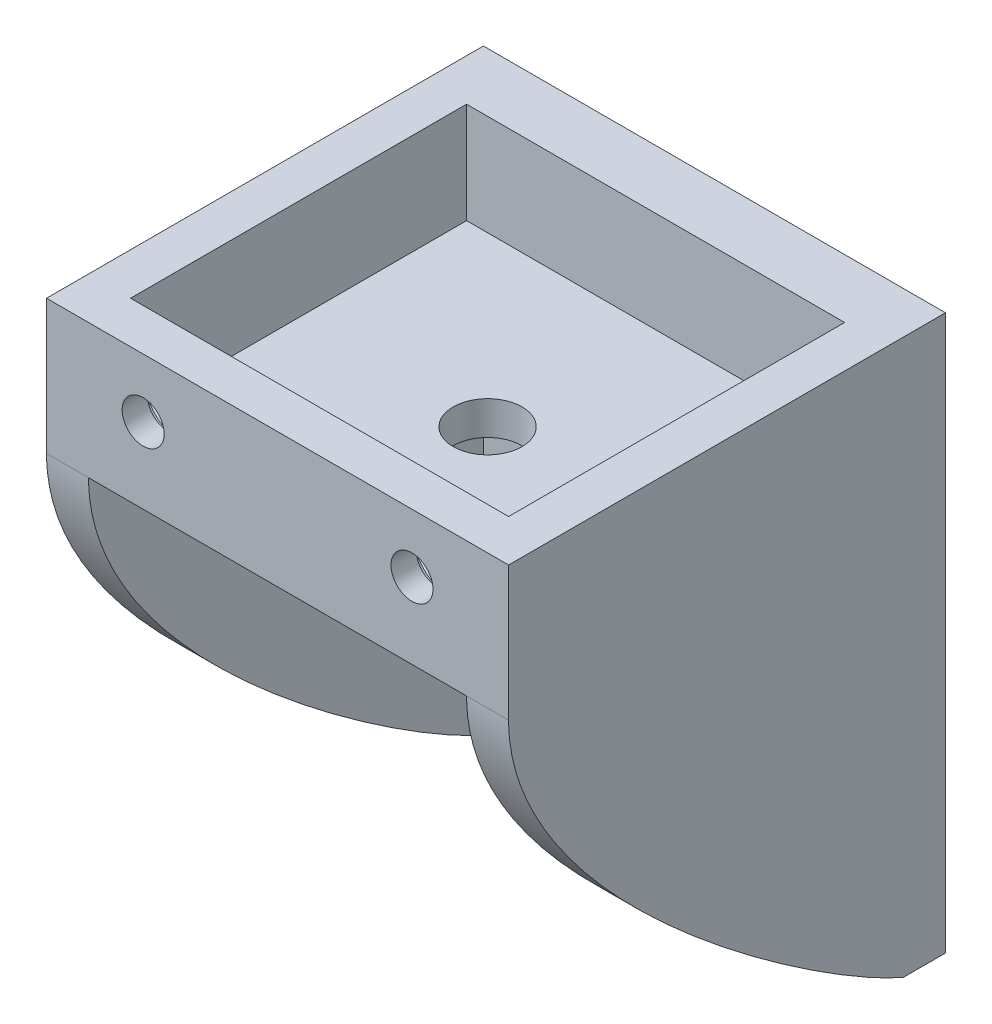
ISO-10303-21;
HEADER;
FILE_DESCRIPTION(('STEP AP214'),'2;1');
FILE_NAME('part.step','',(''),(''),'','','');
FILE_SCHEMA(('AUTOMOTIVE_DESIGN { 1 0 10303 214 1 1 1 1 }'));
ENDSEC;
DATA;
#1=APPLICATION_CONTEXT('core data for automotive mechanical design processes');
#2=APPLICATION_PROTOCOL_DEFINITION('international standard','automotive_design',2000,#1);
#3=PRODUCT_CONTEXT('',#1,'mechanical');
#4=PRODUCT('Part','Part','',(#3));
#5=PRODUCT_RELATED_PRODUCT_CATEGORY('part','',(#4));
#6=PRODUCT_DEFINITION_FORMATION('','',#4);
#7=PRODUCT_DEFINITION_CONTEXT('part definition',#1,'design');
#8=PRODUCT_DEFINITION('design','',#6,#7);
#9=PRODUCT_DEFINITION_SHAPE('','',#8);
#10=(LENGTH_UNIT() NAMED_UNIT(*) SI_UNIT(.MILLI.,.METRE.));
#11=(NAMED_UNIT(*) PLANE_ANGLE_UNIT() SI_UNIT($,.RADIAN.));
#12=(NAMED_UNIT(*) SI_UNIT($,.STERADIAN.) SOLID_ANGLE_UNIT());
#13=UNCERTAINTY_MEASURE_WITH_UNIT(LENGTH_MEASURE(1.E-05),#10,'distance_accuracy_value','');
#14=(GEOMETRIC_REPRESENTATION_CONTEXT(3) GLOBAL_UNCERTAINTY_ASSIGNED_CONTEXT((#13)) GLOBAL_UNIT_ASSIGNED_CONTEXT((#10,
#11,#12)) REPRESENTATION_CONTEXT('',''));
#15=CARTESIAN_POINT('',(0.,0.,0.));
#16=DIRECTION('',(0.,0.,1.));
#17=DIRECTION('',(1.,0.,0.));
#18=AXIS2_PLACEMENT_3D('',#15,#16,#17);
#19=CARTESIAN_POINT('',(16.,34.,47.));
#20=DIRECTION('',(0.,0.,1.));
#21=DIRECTION('',(1.,0.,0.));
#22=AXIS2_PLACEMENT_3D('',#19,#20,#21);
#23=CYLINDRICAL_SURFACE('',#22,2.5);
#24=CARTESIAN_POINT('',(16.,34.,52.));
#25=DIRECTION('',(0.,0.,1.));
#26=DIRECTION('',(1.,0.,0.));
#27=AXIS2_PLACEMENT_3D('',#24,#25,#26);
#28=CIRCLE('',#27,2.5);
#29=CARTESIAN_POINT('',(18.5,34.,52.));
#30=VERTEX_POINT('',#29);
#31=EDGE_CURVE('E182',#30,#30,#28,.T.);
#32=ORIENTED_EDGE('',*,*,#31,.T.);
#33=EDGE_LOOP('',(#32));
#34=FACE_BOUND('',#33,.T.);
#35=CARTESIAN_POINT('',(16.,34.,49.));
#36=DIRECTION('',(0.,0.,-1.));
#37=DIRECTION('',(-1.,0.,0.));
#38=AXIS2_PLACEMENT_3D('',#35,#36,#37);
#39=CIRCLE('',#38,2.5);
#40=CARTESIAN_POINT('',(13.5,34.,49.));
#41=VERTEX_POINT('',#40);
#42=EDGE_CURVE('E229',#41,#41,#39,.F.);
#43=ORIENTED_EDGE('',*,*,#42,.F.);
#44=EDGE_LOOP('',(#43));
#45=FACE_BOUND('',#44,.T.);
#46=ADVANCED_FACE('F33',(#34,#45),#23,.F.);
#47=CARTESIAN_POINT('',(0.,41.,27.));
#48=DIRECTION('',(0.,-1.,0.));
#49=DIRECTION('',(0.,0.,-1.));
#50=AXIS2_PLACEMENT_3D('',#47,#48,#49);
#51=CYLINDRICAL_SURFACE('',#50,4.1);
#52=CARTESIAN_POINT('',(0.,25.,27.));
#53=DIRECTION('',(0.,-1.,0.));
#54=DIRECTION('',(0.,0.,-1.));
#55=AXIS2_PLACEMENT_3D('',#52,#53,#54);
#56=CIRCLE('',#55,4.1);
#57=CARTESIAN_POINT('',(0.,25.,22.9));
#58=VERTEX_POINT('',#57);
#59=EDGE_CURVE('E275',#58,#58,#56,.T.);
#60=ORIENTED_EDGE('',*,*,#59,.T.);
#61=EDGE_LOOP('',(#60));
#62=FACE_BOUND('',#61,.T.);
#63=CARTESIAN_POINT('',(0.,29.,27.));
#64=DIRECTION('',(0.,1.,0.));
#65=DIRECTION('',(0.,0.,1.));
#66=AXIS2_PLACEMENT_3D('',#63,#64,#65);
#67=CIRCLE('',#66,4.1);
#68=CARTESIAN_POINT('',(0.,29.,31.1));
#69=VERTEX_POINT('',#68);
#70=EDGE_CURVE('E188',#69,#69,#67,.F.);
#71=ORIENTED_EDGE('',*,*,#70,.F.);
#72=EDGE_LOOP('',(#71));
#73=FACE_BOUND('',#72,.T.);
#74=ADVANCED_FACE('F439',(#62,#73),#51,.F.);
#75=CARTESIAN_POINT('',(0.,0.,5.));
#76=DIRECTION('',(0.,0.,1.));
#77=DIRECTION('',(1.,0.,0.));
#78=AXIS2_PLACEMENT_3D('',#75,#76,#77);
#79=PLANE('',#78);
#80=DIRECTION('',(1.,0.,0.));
#81=VECTOR('',#80,1.);
#82=CARTESIAN_POINT('',(-27.5,-25.,5.));
#83=LINE('',#82,#81);
#84=CARTESIAN_POINT('',(-22.5,-25.,5.));
#85=VERTEX_POINT('',#84);
#86=CARTESIAN_POINT('',(22.5,-25.,5.));
#87=VERTEX_POINT('',#86);
#88=EDGE_CURVE('E280',#85,#87,#83,.T.);
#89=ORIENTED_EDGE('',*,*,#88,.T.);
#90=DIRECTION('',(0.,-1.,0.));
#91=VECTOR('',#90,1.);
#92=CARTESIAN_POINT('',(22.5,-25.,5.));
#93=LINE('',#92,#91);
#94=CARTESIAN_POINT('',(22.5,-15.,5.));
#95=VERTEX_POINT('',#94);
#96=EDGE_CURVE('E211',#95,#87,#93,.T.);
#97=ORIENTED_EDGE('',*,*,#96,.F.);
#98=CARTESIAN_POINT('',(17.5,-15.,5.));
#99=DIRECTION('',(0.,0.,1.));
#100=DIRECTION('',(1.,0.,0.));
#101=AXIS2_PLACEMENT_3D('',#98,#99,#100);
#102=CIRCLE('',#101,5.);
#103=EDGE_CURVE('E304',#95,#95,#102,.T.);
#104=ORIENTED_EDGE('',*,*,#103,.F.);
#105=CARTESIAN_POINT('',(22.5,15.,5.));
#106=VERTEX_POINT('',#105);
#107=EDGE_CURVE('E223',#106,#95,#93,.T.);
#108=ORIENTED_EDGE('',*,*,#107,.F.);
#109=CARTESIAN_POINT('',(17.5,15.,5.));
#110=DIRECTION('',(0.,0.,1.));
#111=DIRECTION('',(1.,0.,0.));
#112=AXIS2_PLACEMENT_3D('',#109,#110,#111);
#113=CIRCLE('',#112,5.);
#114=EDGE_CURVE('E293',#106,#106,#113,.T.);
#115=ORIENTED_EDGE('',*,*,#114,.F.);
#116=CARTESIAN_POINT('',(22.5,25.,5.));
#117=VERTEX_POINT('',#116);
#118=EDGE_CURVE('E196',#117,#106,#93,.T.);
#119=ORIENTED_EDGE('',*,*,#118,.F.);
#120=DIRECTION('',(-1.,0.,0.));
#121=VECTOR('',#120,1.);
#122=CARTESIAN_POINT('',(-27.5,25.,5.));
#123=LINE('',#122,#121);
#124=CARTESIAN_POINT('',(-22.5,25.,5.));
#125=VERTEX_POINT('',#124);
#126=EDGE_CURVE('E332',#117,#125,#123,.T.);
#127=ORIENTED_EDGE('',*,*,#126,.T.);
#128=DIRECTION('',(0.,-1.,0.));
#129=VECTOR('',#128,1.);
#130=CARTESIAN_POINT('',(-22.5,-25.,5.));
#131=LINE('',#130,#129);
#132=CARTESIAN_POINT('',(-22.5,15.,5.));
#133=VERTEX_POINT('',#132);
#134=EDGE_CURVE('E349',#125,#133,#131,.T.);
#135=ORIENTED_EDGE('',*,*,#134,.T.);
#136=CARTESIAN_POINT('',(-17.5,15.,5.));
#137=DIRECTION('',(0.,0.,1.));
#138=DIRECTION('',(-1.,0.,0.));
#139=AXIS2_PLACEMENT_3D('',#136,#137,#138);
#140=CIRCLE('',#139,5.);
#141=EDGE_CURVE('E297',#133,#133,#140,.T.);
#142=ORIENTED_EDGE('',*,*,#141,.F.);
#143=CARTESIAN_POINT('',(-22.5,-15.,5.));
#144=VERTEX_POINT('',#143);
#145=EDGE_CURVE('E344',#133,#144,#131,.T.);
#146=ORIENTED_EDGE('',*,*,#145,.T.);
#147=CARTESIAN_POINT('',(-17.5,-15.,5.));
#148=DIRECTION('',(0.,0.,1.));
#149=DIRECTION('',(1.,0.,0.));
#150=AXIS2_PLACEMENT_3D('',#147,#148,#149);
#151=CIRCLE('',#150,5.);
#152=EDGE_CURVE('E303',#144,#144,#151,.T.);
#153=ORIENTED_EDGE('',*,*,#152,.F.);
#154=EDGE_CURVE('E340',#144,#85,#131,.T.);
#155=ORIENTED_EDGE('',*,*,#154,.T.);
#156=EDGE_LOOP('',(#89,#97,#104,#108,#115,#119,#127,#135,#142,#146,#153,#155));
#157=FACE_BOUND('',#156,.T.);
#158=ADVANCED_FACE('F390',(#157),#79,.T.);
#159=CARTESIAN_POINT('',(0.,25.,0.));
#160=DIRECTION('',(0.,1.,0.));
#161=DIRECTION('',(0.,0.,1.));
#162=AXIS2_PLACEMENT_3D('',#159,#160,#161);
#163=PLANE('',#162);
#164=ORIENTED_EDGE('',*,*,#59,.F.);
#165=EDGE_LOOP('',(#164));
#166=FACE_BOUND('',#165,.T.);
#167=DIRECTION('',(0.,0.,-1.));
#168=VECTOR('',#167,1.);
#169=CARTESIAN_POINT('',(22.5,25.,5.));
#170=LINE('',#169,#168);
#171=CARTESIAN_POINT('',(22.5,25.,52.));
#172=VERTEX_POINT('',#171);
#173=EDGE_CURVE('E225',#172,#117,#170,.T.);
#174=ORIENTED_EDGE('',*,*,#173,.F.);
#175=DIRECTION('',(1.,0.,0.));
#176=VECTOR('',#175,1.);
#177=CARTESIAN_POINT('',(-27.5,25.,52.));
#178=LINE('',#177,#176);
#179=CARTESIAN_POINT('',(-22.5,25.,52.));
#180=VERTEX_POINT('',#179);
#181=EDGE_CURVE('E265',#180,#172,#178,.T.);
#182=ORIENTED_EDGE('',*,*,#181,.F.);
#183=DIRECTION('',(0.,0.,-1.));
#184=VECTOR('',#183,1.);
#185=CARTESIAN_POINT('',(-22.5,25.,5.));
#186=LINE('',#185,#184);
#187=EDGE_CURVE('E345',#180,#125,#186,.T.);
#188=ORIENTED_EDGE('',*,*,#187,.T.);
#189=ORIENTED_EDGE('',*,*,#126,.F.);
#190=EDGE_LOOP('',(#174,#182,#188,#189));
#191=FACE_BOUND('',#190,.T.);
#192=ADVANCED_FACE('F410',(#166,#191),#163,.F.);
#193=CARTESIAN_POINT('',(-17.5,-15.,5.));
#194=DIRECTION('',(0.,0.,-1.));
#195=DIRECTION('',(-1.,0.,0.));
#196=AXIS2_PLACEMENT_3D('',#193,#194,#195);
#197=CYLINDRICAL_SURFACE('',#196,2.5);
#198=CARTESIAN_POINT('',(-17.5,-15.,0.));
#199=DIRECTION('',(0.,0.,1.));
#200=DIRECTION('',(1.,0.,0.));
#201=AXIS2_PLACEMENT_3D('',#198,#199,#200);
#202=CIRCLE('',#201,2.5);
#203=CARTESIAN_POINT('',(-15.,-15.,0.));
#204=VERTEX_POINT('',#203);
#205=EDGE_CURVE('E328',#204,#204,#202,.T.);
#206=ORIENTED_EDGE('',*,*,#205,.F.);
#207=EDGE_LOOP('',(#206));
#208=FACE_BOUND('',#207,.T.);
#209=CARTESIAN_POINT('',(-17.5,-15.,3.));
#210=DIRECTION('',(0.,0.,1.));
#211=DIRECTION('',(1.,0.,0.));
#212=AXIS2_PLACEMENT_3D('',#209,#210,#211);
#213=CIRCLE('',#212,2.5);
#214=CARTESIAN_POINT('',(-15.,-15.,3.));
#215=VERTEX_POINT('',#214);
#216=EDGE_CURVE('E322',#215,#215,#213,.T.);
#217=ORIENTED_EDGE('',*,*,#216,.T.);
#218=EDGE_LOOP('',(#217));
#219=FACE_BOUND('',#218,.T.);
#220=ADVANCED_FACE('F484',(#208,#219),#197,.F.);
#221=CARTESIAN_POINT('',(17.5,-15.,5.));
#222=DIRECTION('',(0.,0.,-1.));
#223=DIRECTION('',(-1.,0.,0.));
#224=AXIS2_PLACEMENT_3D('',#221,#222,#223);
#225=CYLINDRICAL_SURFACE('',#224,2.5);
#226=CARTESIAN_POINT('',(17.5,-15.,0.));
#227=DIRECTION('',(0.,0.,1.));
#228=DIRECTION('',(-1.,0.,0.));
#229=AXIS2_PLACEMENT_3D('',#226,#227,#228);
#230=CIRCLE('',#229,2.5);
#231=CARTESIAN_POINT('',(15.,-15.,0.));
#232=VERTEX_POINT('',#231);
#233=EDGE_CURVE('E325',#232,#232,#230,.T.);
#234=ORIENTED_EDGE('',*,*,#233,.F.);
#235=EDGE_LOOP('',(#234));
#236=FACE_BOUND('',#235,.T.);
#237=CARTESIAN_POINT('',(17.5,-15.,3.));
#238=DIRECTION('',(0.,0.,1.));
#239=DIRECTION('',(1.,0.,0.));
#240=AXIS2_PLACEMENT_3D('',#237,#238,#239);
#241=CIRCLE('',#240,2.5);
#242=CARTESIAN_POINT('',(20.,-15.,3.));
#243=VERTEX_POINT('',#242);
#244=EDGE_CURVE('E783',#243,#243,#241,.T.);
#245=ORIENTED_EDGE('',*,*,#244,.T.);
#246=EDGE_LOOP('',(#245));
#247=FACE_BOUND('',#246,.T.);
#248=ADVANCED_FACE('F518',(#236,#247),#225,.F.);
#249=CARTESIAN_POINT('',(17.5,15.,5.));
#250=DIRECTION('',(0.,0.,-1.));
#251=DIRECTION('',(-1.,0.,0.));
#252=AXIS2_PLACEMENT_3D('',#249,#250,#251);
#253=CYLINDRICAL_SURFACE('',#252,2.5);
#254=CARTESIAN_POINT('',(17.5,15.,0.));
#255=DIRECTION('',(0.,0.,1.));
#256=DIRECTION('',(1.,0.,0.));
#257=AXIS2_PLACEMENT_3D('',#254,#255,#256);
#258=CIRCLE('',#257,2.5);
#259=CARTESIAN_POINT('',(20.,15.,0.));
#260=VERTEX_POINT('',#259);
#261=EDGE_CURVE('E321',#260,#260,#258,.T.);
#262=ORIENTED_EDGE('',*,*,#261,.F.);
#263=EDGE_LOOP('',(#262));
#264=FACE_BOUND('',#263,.T.);
#265=CARTESIAN_POINT('',(17.5,15.,3.));
#266=DIRECTION('',(0.,0.,1.));
#267=DIRECTION('',(1.,0.,0.));
#268=AXIS2_PLACEMENT_3D('',#265,#266,#267);
#269=CIRCLE('',#268,2.5);
#270=CARTESIAN_POINT('',(20.,15.,3.));
#271=VERTEX_POINT('',#270);
#272=EDGE_CURVE('E782',#271,#271,#269,.T.);
#273=ORIENTED_EDGE('',*,*,#272,.T.);
#274=EDGE_LOOP('',(#273));
#275=FACE_BOUND('',#274,.T.);
#276=ADVANCED_FACE('F514',(#264,#275),#253,.F.);
#277=CARTESIAN_POINT('',(0.,0.,0.));
#278=DIRECTION('',(0.,0.,1.));
#279=DIRECTION('',(1.,0.,0.));
#280=AXIS2_PLACEMENT_3D('',#277,#278,#279);
#281=PLANE('',#280);
#282=DIRECTION('',(0.,1.,0.));
#283=VECTOR('',#282,1.);
#284=CARTESIAN_POINT('',(27.5,25.,0.));
#285=LINE('',#284,#283);
#286=CARTESIAN_POINT('',(27.5,-25.,0.));
#287=VERTEX_POINT('',#286);
#288=CARTESIAN_POINT('',(27.5,41.,0.));
#289=VERTEX_POINT('',#288);
#290=EDGE_CURVE('E331',#287,#289,#285,.T.);
#291=ORIENTED_EDGE('',*,*,#290,.F.);
#292=DIRECTION('',(1.,0.,0.));
#293=VECTOR('',#292,1.);
#294=CARTESIAN_POINT('',(-27.5,-25.,0.));
#295=LINE('',#294,#293);
#296=CARTESIAN_POINT('',(-27.5,-25.,0.));
#297=VERTEX_POINT('',#296);
#298=EDGE_CURVE('E333',#297,#287,#295,.T.);
#299=ORIENTED_EDGE('',*,*,#298,.F.);
#300=DIRECTION('',(0.,-1.,0.));
#301=VECTOR('',#300,1.);
#302=CARTESIAN_POINT('',(-27.5,25.,0.));
#303=LINE('',#302,#301);
#304=CARTESIAN_POINT('',(-27.5,41.,0.));
#305=VERTEX_POINT('',#304);
#306=EDGE_CURVE('E376',#305,#297,#303,.T.);
#307=ORIENTED_EDGE('',*,*,#306,.F.);
#308=DIRECTION('',(-1.,0.,0.));
#309=VECTOR('',#308,1.);
#310=CARTESIAN_POINT('',(-27.5,41.,0.));
#311=LINE('',#310,#309);
#312=EDGE_CURVE('E286',#289,#305,#311,.T.);
#313=ORIENTED_EDGE('',*,*,#312,.F.);
#314=EDGE_LOOP('',(#291,#299,#307,#313));
#315=FACE_BOUND('',#314,.T.);
#316=ORIENTED_EDGE('',*,*,#205,.T.);
#317=EDGE_LOOP('',(#316));
#318=FACE_BOUND('',#317,.T.);
#319=ORIENTED_EDGE('',*,*,#233,.T.);
#320=EDGE_LOOP('',(#319));
#321=FACE_BOUND('',#320,.T.);
#322=ORIENTED_EDGE('',*,*,#261,.T.);
#323=EDGE_LOOP('',(#322));
#324=FACE_BOUND('',#323,.T.);
#325=CARTESIAN_POINT('',(-17.5,15.,0.));
#326=DIRECTION('',(0.,0.,1.));
#327=DIRECTION('',(-1.,0.,0.));
#328=AXIS2_PLACEMENT_3D('',#325,#326,#327);
#329=CIRCLE('',#328,2.5);
#330=CARTESIAN_POINT('',(-20.,15.,0.));
#331=VERTEX_POINT('',#330);
#332=EDGE_CURVE('E318',#331,#331,#329,.T.);
#333=ORIENTED_EDGE('',*,*,#332,.T.);
#334=EDGE_LOOP('',(#333));
#335=FACE_BOUND('',#334,.T.);
#336=ADVANCED_FACE('F517',(#315,#318,#321,#324,#335),#281,.F.);
#337=CARTESIAN_POINT('',(27.5,25.,5.));
#338=DIRECTION('',(-1.,0.,0.));
#339=DIRECTION('',(0.,-1.,0.));
#340=AXIS2_PLACEMENT_3D('',#337,#338,#339);
#341=PLANE('',#340);
#342=ORIENTED_EDGE('',*,*,#290,.T.);
#343=DIRECTION('',(0.,0.,-1.));
#344=VECTOR('',#343,1.);
#345=CARTESIAN_POINT('',(27.5,41.,0.));
#346=LINE('',#345,#344);
#347=CARTESIAN_POINT('',(27.5,41.,52.));
#348=VERTEX_POINT('',#347);
#349=EDGE_CURVE('E364',#348,#289,#346,.T.);
#350=ORIENTED_EDGE('',*,*,#349,.F.);
#351=DIRECTION('',(0.,-1.,0.));
#352=VECTOR('',#351,1.);
#353=CARTESIAN_POINT('',(27.5,41.,52.));
#354=LINE('',#353,#352);
#355=CARTESIAN_POINT('',(27.5,25.,52.));
#356=VERTEX_POINT('',#355);
#357=EDGE_CURVE('E288',#348,#356,#354,.T.);
#358=ORIENTED_EDGE('',*,*,#357,.T.);
#359=CARTESIAN_POINT('',(27.5,-25.,4.99999999999999));
#360=CARTESIAN_POINT('',(27.5,-20.7199182538741,15.2666346797888));
#361=CARTESIAN_POINT('',(27.5,4.23297016209857,51.9999999999999));
#362=CARTESIAN_POINT('',(27.5,25.,52.));
#363=B_SPLINE_CURVE_WITH_KNOTS('',3,(#359,#360,#361,#362),.UNSPECIFIED.,.F.,.F.,(4,4),(0.,
0.911487556733468),.UNSPECIFIED.);
#364=CARTESIAN_POINT('',(27.5,-25.,5.));
#365=VERTEX_POINT('',#364);
#366=EDGE_CURVE('E212',#365,#356,#363,.T.);
#367=ORIENTED_EDGE('',*,*,#366,.F.);
#368=DIRECTION('',(0.,0.,-1.));
#369=VECTOR('',#368,1.);
#370=CARTESIAN_POINT('',(27.5,-25.,5.));
#371=LINE('',#370,#369);
#372=EDGE_CURVE('E42',#365,#287,#371,.T.);
#373=ORIENTED_EDGE('',*,*,#372,.T.);
#374=EDGE_LOOP('',(#342,#350,#358,#367,#373));
#375=FACE_BOUND('',#374,.T.);
#376=ADVANCED_FACE('F35',(#375),#341,.F.);
#377=CARTESIAN_POINT('',(-27.5,25.,5.));
#378=DIRECTION('',(1.,0.,0.));
#379=DIRECTION('',(0.,1.,0.));
#380=AXIS2_PLACEMENT_3D('',#377,#378,#379);
#381=PLANE('',#380);
#382=DIRECTION('',(0.,0.,-1.));
#383=VECTOR('',#382,1.);
#384=CARTESIAN_POINT('',(-27.5,-25.,5.));
#385=LINE('',#384,#383);
#386=CARTESIAN_POINT('',(-27.5,-25.,5.));
#387=VERTEX_POINT('',#386);
#388=EDGE_CURVE('E11',#387,#297,#385,.T.);
#389=ORIENTED_EDGE('',*,*,#388,.F.);
#390=CARTESIAN_POINT('',(-27.5,-25.,4.99999999999999));
#391=CARTESIAN_POINT('',(-27.5,-20.7199182538741,15.2666346797888));
#392=CARTESIAN_POINT('',(-27.5,4.23297016209857,51.9999999999999));
#393=CARTESIAN_POINT('',(-27.5,25.,52.));
#394=B_SPLINE_CURVE_WITH_KNOTS('',3,(#390,#391,#392,#393),.UNSPECIFIED.,.F.,.F.,(4,4),(0.,
0.911487556733468),.UNSPECIFIED.);
#395=CARTESIAN_POINT('',(-27.5,25.,52.));
#396=VERTEX_POINT('',#395);
#397=EDGE_CURVE('E218',#387,#396,#394,.T.);
#398=ORIENTED_EDGE('',*,*,#397,.T.);
#399=DIRECTION('',(0.,-1.,0.));
#400=VECTOR('',#399,1.);
#401=CARTESIAN_POINT('',(-27.5,41.,52.));
#402=LINE('',#401,#400);
#403=CARTESIAN_POINT('',(-27.5,41.,52.));
#404=VERTEX_POINT('',#403);
#405=EDGE_CURVE('E267',#404,#396,#402,.T.);
#406=ORIENTED_EDGE('',*,*,#405,.F.);
#407=DIRECTION('',(0.,0.,1.));
#408=VECTOR('',#407,1.);
#409=CARTESIAN_POINT('',(-27.5,41.,0.));
#410=LINE('',#409,#408);
#411=EDGE_CURVE('E270',#305,#404,#410,.T.);
#412=ORIENTED_EDGE('',*,*,#411,.F.);
#413=ORIENTED_EDGE('',*,*,#306,.T.);
#414=EDGE_LOOP('',(#389,#398,#406,#412,#413));
#415=FACE_BOUND('',#414,.T.);
#416=ADVANCED_FACE('F375',(#415),#381,.F.);
#417=CARTESIAN_POINT('',(-27.5,-25.,5.));
#418=DIRECTION('',(0.,1.,0.));
#419=DIRECTION('',(0.,0.,1.));
#420=AXIS2_PLACEMENT_3D('',#417,#418,#419);
#421=PLANE('',#420);
#422=ORIENTED_EDGE('',*,*,#298,.T.);
#423=ORIENTED_EDGE('',*,*,#372,.F.);
#424=DIRECTION('',(1.,0.,0.));
#425=VECTOR('',#424,1.);
#426=CARTESIAN_POINT('',(22.5,-25.,5.));
#427=LINE('',#426,#425);
#428=EDGE_CURVE('E219',#87,#365,#427,.T.);
#429=ORIENTED_EDGE('',*,*,#428,.F.);
#430=ORIENTED_EDGE('',*,*,#88,.F.);
#431=EDGE_CURVE('E338',#387,#85,#83,.T.);
#432=ORIENTED_EDGE('',*,*,#431,.F.);
#433=ORIENTED_EDGE('',*,*,#388,.T.);
#434=EDGE_LOOP('',(#422,#423,#429,#430,#432,#433));
#435=FACE_BOUND('',#434,.T.);
#436=ADVANCED_FACE('F393',(#435),#421,.F.);
#437=CARTESIAN_POINT('',(-17.5,15.,5.));
#438=DIRECTION('',(0.,0.,-1.));
#439=DIRECTION('',(-1.,0.,0.));
#440=AXIS2_PLACEMENT_3D('',#437,#438,#439);
#441=CYLINDRICAL_SURFACE('',#440,2.5);
#442=CARTESIAN_POINT('',(-17.5,15.,3.));
#443=DIRECTION('',(0.,0.,-1.));
#444=DIRECTION('',(-1.,0.,0.));
#445=AXIS2_PLACEMENT_3D('',#442,#443,#444);
#446=CIRCLE('',#445,2.5);
#447=CARTESIAN_POINT('',(-20.,15.,3.));
#448=VERTEX_POINT('',#447);
#449=EDGE_CURVE('E315',#448,#448,#446,.T.);
#450=ORIENTED_EDGE('',*,*,#449,.F.);
#451=EDGE_LOOP('',(#450));
#452=FACE_BOUND('',#451,.T.);
#453=ORIENTED_EDGE('',*,*,#332,.F.);
#454=EDGE_LOOP('',(#453));
#455=FACE_BOUND('',#454,.T.);
#456=ADVANCED_FACE('F510',(#452,#455),#441,.F.);
#457=CARTESIAN_POINT('',(-17.5,15.,3.));
#458=DIRECTION('',(0.,0.,1.));
#459=DIRECTION('',(1.,0.,0.));
#460=AXIS2_PLACEMENT_3D('',#457,#458,#459);
#461=CYLINDRICAL_SURFACE('',#460,5.);
#462=CARTESIAN_POINT('',(-17.5,15.,3.));
#463=DIRECTION('',(0.,0.,1.));
#464=DIRECTION('',(-1.,0.,0.));
#465=AXIS2_PLACEMENT_3D('',#462,#463,#464);
#466=CIRCLE('',#465,5.);
#467=CARTESIAN_POINT('',(-22.5,15.,3.));
#468=VERTEX_POINT('',#467);
#469=EDGE_CURVE('E307',#468,#468,#466,.T.);
#470=ORIENTED_EDGE('',*,*,#469,.F.);
#471=EDGE_LOOP('',(#470));
#472=FACE_BOUND('',#471,.T.);
#473=ORIENTED_EDGE('',*,*,#141,.T.);
#474=EDGE_LOOP('',(#473));
#475=FACE_BOUND('',#474,.T.);
#476=ADVANCED_FACE('F493',(#472,#475),#461,.F.);
#477=CARTESIAN_POINT('',(-17.5,15.,3.));
#478=DIRECTION('',(0.,0.,-1.));
#479=DIRECTION('',(-1.,0.,0.));
#480=AXIS2_PLACEMENT_3D('',#477,#478,#479);
#481=PLANE('',#480);
#482=ORIENTED_EDGE('',*,*,#449,.T.);
#483=EDGE_LOOP('',(#482));
#484=FACE_BOUND('',#483,.T.);
#485=ORIENTED_EDGE('',*,*,#469,.T.);
#486=EDGE_LOOP('',(#485));
#487=FACE_BOUND('',#486,.T.);
#488=ADVANCED_FACE('F488',(#484,#487),#481,.F.);
#489=CARTESIAN_POINT('',(17.5,15.,3.));
#490=DIRECTION('',(0.,0.,1.));
#491=DIRECTION('',(1.,0.,0.));
#492=AXIS2_PLACEMENT_3D('',#489,#490,#491);
#493=CYLINDRICAL_SURFACE('',#492,5.);
#494=CARTESIAN_POINT('',(17.5,15.,3.));
#495=DIRECTION('',(0.,0.,1.));
#496=DIRECTION('',(1.,0.,0.));
#497=AXIS2_PLACEMENT_3D('',#494,#495,#496);
#498=CIRCLE('',#497,5.);
#499=CARTESIAN_POINT('',(22.5,15.,3.));
#500=VERTEX_POINT('',#499);
#501=EDGE_CURVE('E294',#500,#500,#498,.T.);
#502=ORIENTED_EDGE('',*,*,#501,.F.);
#503=EDGE_LOOP('',(#502));
#504=FACE_BOUND('',#503,.T.);
#505=ORIENTED_EDGE('',*,*,#114,.T.);
#506=EDGE_LOOP('',(#505));
#507=FACE_BOUND('',#506,.T.);
#508=ADVANCED_FACE('F433',(#504,#507),#493,.F.);
#509=CARTESIAN_POINT('',(17.5,15.,3.));
#510=DIRECTION('',(0.,0.,1.));
#511=DIRECTION('',(1.,0.,0.));
#512=AXIS2_PLACEMENT_3D('',#509,#510,#511);
#513=PLANE('',#512);
#514=ORIENTED_EDGE('',*,*,#272,.F.);
#515=EDGE_LOOP('',(#514));
#516=FACE_BOUND('',#515,.T.);
#517=ORIENTED_EDGE('',*,*,#501,.T.);
#518=EDGE_LOOP('',(#517));
#519=FACE_BOUND('',#518,.T.);
#520=ADVANCED_FACE('F423',(#516,#519),#513,.T.);
#521=CARTESIAN_POINT('',(17.5,-15.,3.));
#522=DIRECTION('',(0.,0.,1.));
#523=DIRECTION('',(1.,0.,0.));
#524=AXIS2_PLACEMENT_3D('',#521,#522,#523);
#525=CYLINDRICAL_SURFACE('',#524,5.);
#526=CARTESIAN_POINT('',(17.5,-15.,3.));
#527=DIRECTION('',(0.,0.,1.));
#528=DIRECTION('',(1.,0.,0.));
#529=AXIS2_PLACEMENT_3D('',#526,#527,#528);
#530=CIRCLE('',#529,5.);
#531=CARTESIAN_POINT('',(22.5,-15.,3.));
#532=VERTEX_POINT('',#531);
#533=EDGE_CURVE('E300',#532,#532,#530,.T.);
#534=ORIENTED_EDGE('',*,*,#533,.F.);
#535=EDGE_LOOP('',(#534));
#536=FACE_BOUND('',#535,.T.);
#537=ORIENTED_EDGE('',*,*,#103,.T.);
#538=EDGE_LOOP('',(#537));
#539=FACE_BOUND('',#538,.T.);
#540=ADVANCED_FACE('F420',(#536,#539),#525,.F.);
#541=CARTESIAN_POINT('',(17.5,-15.,3.));
#542=DIRECTION('',(0.,0.,1.));
#543=DIRECTION('',(1.,0.,0.));
#544=AXIS2_PLACEMENT_3D('',#541,#542,#543);
#545=PLANE('',#544);
#546=ORIENTED_EDGE('',*,*,#244,.F.);
#547=EDGE_LOOP('',(#546));
#548=FACE_BOUND('',#547,.T.);
#549=ORIENTED_EDGE('',*,*,#533,.T.);
#550=EDGE_LOOP('',(#549));
#551=FACE_BOUND('',#550,.T.);
#552=ADVANCED_FACE('F422',(#548,#551),#545,.T.);
#553=CARTESIAN_POINT('',(-17.5,-15.,3.));
#554=DIRECTION('',(0.,0.,1.));
#555=DIRECTION('',(1.,0.,0.));
#556=AXIS2_PLACEMENT_3D('',#553,#554,#555);
#557=CYLINDRICAL_SURFACE('',#556,5.);
#558=CARTESIAN_POINT('',(-17.5,-15.,3.));
#559=DIRECTION('',(0.,0.,1.));
#560=DIRECTION('',(1.,0.,0.));
#561=AXIS2_PLACEMENT_3D('',#558,#559,#560);
#562=CIRCLE('',#561,5.);
#563=CARTESIAN_POINT('',(-12.5,-15.,3.));
#564=VERTEX_POINT('',#563);
#565=EDGE_CURVE('E312',#564,#564,#562,.T.);
#566=ORIENTED_EDGE('',*,*,#565,.F.);
#567=EDGE_LOOP('',(#566));
#568=FACE_BOUND('',#567,.T.);
#569=ORIENTED_EDGE('',*,*,#152,.T.);
#570=EDGE_LOOP('',(#569));
#571=FACE_BOUND('',#570,.T.);
#572=ADVANCED_FACE('F430',(#568,#571),#557,.F.);
#573=CARTESIAN_POINT('',(-17.5,-15.,3.));
#574=DIRECTION('',(0.,0.,1.));
#575=DIRECTION('',(1.,0.,0.));
#576=AXIS2_PLACEMENT_3D('',#573,#574,#575);
#577=PLANE('',#576);
#578=ORIENTED_EDGE('',*,*,#216,.F.);
#579=EDGE_LOOP('',(#578));
#580=FACE_BOUND('',#579,.T.);
#581=ORIENTED_EDGE('',*,*,#565,.T.);
#582=EDGE_LOOP('',(#581));
#583=FACE_BOUND('',#582,.T.);
#584=ADVANCED_FACE('F256',(#580,#583),#577,.T.);
#585=CARTESIAN_POINT('',(-27.5,41.,52.));
#586=DIRECTION('',(0.,0.,-1.));
#587=DIRECTION('',(-1.,0.,0.));
#588=AXIS2_PLACEMENT_3D('',#585,#586,#587);
#589=PLANE('',#588);
#590=ORIENTED_EDGE('',*,*,#31,.F.);
#591=EDGE_LOOP('',(#590));
#592=FACE_BOUND('',#591,.T.);
#593=CARTESIAN_POINT('',(-16.,34.,52.));
#594=DIRECTION('',(0.,0.,1.));
#595=DIRECTION('',(-1.,0.,0.));
#596=AXIS2_PLACEMENT_3D('',#593,#594,#595);
#597=CIRCLE('',#596,2.5);
#598=CARTESIAN_POINT('',(-18.5,34.,52.));
#599=VERTEX_POINT('',#598);
#600=EDGE_CURVE('E173',#599,#599,#597,.T.);
#601=ORIENTED_EDGE('',*,*,#600,.F.);
#602=EDGE_LOOP('',(#601));
#603=FACE_BOUND('',#602,.T.);
#604=EDGE_CURVE('E263',#396,#180,#178,.T.);
#605=ORIENTED_EDGE('',*,*,#604,.T.);
#606=ORIENTED_EDGE('',*,*,#181,.T.);
#607=DIRECTION('',(1.,0.,0.));
#608=VECTOR('',#607,1.);
#609=CARTESIAN_POINT('',(22.5,25.,52.));
#610=LINE('',#609,#608);
#611=EDGE_CURVE('E215',#172,#356,#610,.T.);
#612=ORIENTED_EDGE('',*,*,#611,.T.);
#613=ORIENTED_EDGE('',*,*,#357,.F.);
#614=DIRECTION('',(1.,0.,0.));
#615=VECTOR('',#614,1.);
#616=CARTESIAN_POINT('',(-27.5,41.,52.));
#617=LINE('',#616,#615);
#618=EDGE_CURVE('E273',#404,#348,#617,.T.);
#619=ORIENTED_EDGE('',*,*,#618,.F.);
#620=ORIENTED_EDGE('',*,*,#405,.T.);
#621=EDGE_LOOP('',(#605,#606,#612,#613,#619,#620));
#622=FACE_BOUND('',#621,.T.);
#623=ADVANCED_FACE('F252',(#592,#603,#622),#589,.F.);
#624=CARTESIAN_POINT('',(0.,41.,0.));
#625=DIRECTION('',(0.,1.,0.));
#626=DIRECTION('',(0.,0.,1.));
#627=AXIS2_PLACEMENT_3D('',#624,#625,#626);
#628=PLANE('',#627);
#629=DIRECTION('',(0.,0.,-1.));
#630=VECTOR('',#629,1.);
#631=CARTESIAN_POINT('',(22.5,41.,7.));
#632=LINE('',#631,#630);
#633=CARTESIAN_POINT('',(22.5,41.,47.));
#634=VERTEX_POINT('',#633);
#635=CARTESIAN_POINT('',(22.5,41.,7.));
#636=VERTEX_POINT('',#635);
#637=EDGE_CURVE('E146',#634,#636,#632,.T.);
#638=ORIENTED_EDGE('',*,*,#637,.F.);
#639=DIRECTION('',(1.,0.,0.));
#640=VECTOR('',#639,1.);
#641=CARTESIAN_POINT('',(-22.5,41.,47.));
#642=LINE('',#641,#640);
#643=CARTESIAN_POINT('',(-22.5,41.,47.));
#644=VERTEX_POINT('',#643);
#645=EDGE_CURVE('E167',#644,#634,#642,.T.);
#646=ORIENTED_EDGE('',*,*,#645,.F.);
#647=DIRECTION('',(0.,0.,1.));
#648=VECTOR('',#647,1.);
#649=CARTESIAN_POINT('',(-22.5,41.,7.));
#650=LINE('',#649,#648);
#651=CARTESIAN_POINT('',(-22.5,41.,7.));
#652=VERTEX_POINT('',#651);
#653=EDGE_CURVE('E170',#652,#644,#650,.T.);
#654=ORIENTED_EDGE('',*,*,#653,.F.);
#655=DIRECTION('',(-1.,0.,0.));
#656=VECTOR('',#655,1.);
#657=CARTESIAN_POINT('',(-22.5,41.,7.));
#658=LINE('',#657,#656);
#659=EDGE_CURVE('E181',#636,#652,#658,.T.);
#660=ORIENTED_EDGE('',*,*,#659,.F.);
#661=EDGE_LOOP('',(#638,#646,#654,#660));
#662=FACE_BOUND('',#661,.T.);
#663=ORIENTED_EDGE('',*,*,#411,.T.);
#664=ORIENTED_EDGE('',*,*,#618,.T.);
#665=ORIENTED_EDGE('',*,*,#349,.T.);
#666=ORIENTED_EDGE('',*,*,#312,.T.);
#667=EDGE_LOOP('',(#663,#664,#665,#666));
#668=FACE_BOUND('',#667,.T.);
#669=ADVANCED_FACE('F255',(#662,#668),#628,.T.);
#670=CARTESIAN_POINT('',(-22.5,-25.,4.99999999999999));
#671=CARTESIAN_POINT('',(-22.5,-20.7199182538741,15.2666346797888));
#672=CARTESIAN_POINT('',(-22.5,4.23297016209857,51.9999999999999));
#673=CARTESIAN_POINT('',(-22.5,25.,52.));
#674=B_SPLINE_CURVE_WITH_KNOTS('',3,(#670,#671,#672,#673),.UNSPECIFIED.,.F.,.F.,(4,4),(0.,
0.911487556733468),.UNSPECIFIED.);
#675=DIRECTION('',(-1.,0.,0.));
#676=VECTOR('',#675,1.);
#677=SURFACE_OF_LINEAR_EXTRUSION('',#674,#676);
#678=ORIENTED_EDGE('',*,*,#397,.F.);
#679=ORIENTED_EDGE('',*,*,#431,.T.);
#680=EDGE_CURVE('E346',#85,#180,#674,.T.);
#681=ORIENTED_EDGE('',*,*,#680,.T.);
#682=ORIENTED_EDGE('',*,*,#604,.F.);
#683=EDGE_LOOP('',(#678,#679,#681,#682));
#684=FACE_BOUND('',#683,.T.);
#685=ADVANCED_FACE('F378',(#684),#677,.T.);
#686=CARTESIAN_POINT('',(-22.5,-6.18260553441581,32.3499880049208));
#687=DIRECTION('',(-1.,0.,0.));
#688=DIRECTION('',(0.,-1.,0.));
#689=AXIS2_PLACEMENT_3D('',#686,#687,#688);
#690=PLANE('',#689);
#691=ORIENTED_EDGE('',*,*,#680,.F.);
#692=ORIENTED_EDGE('',*,*,#154,.F.);
#693=ORIENTED_EDGE('',*,*,#145,.F.);
#694=ORIENTED_EDGE('',*,*,#134,.F.);
#695=ORIENTED_EDGE('',*,*,#187,.F.);
#696=EDGE_LOOP('',(#691,#692,#693,#694,#695));
#697=FACE_BOUND('',#696,.T.);
#698=ADVANCED_FACE('F383',(#697),#690,.F.);
#699=CARTESIAN_POINT('',(22.5,-25.,4.99999999999999));
#700=CARTESIAN_POINT('',(22.5,-20.7199182538741,15.2666346797888));
#701=CARTESIAN_POINT('',(22.5,4.23297016209857,51.9999999999999));
#702=CARTESIAN_POINT('',(22.5,25.,52.));
#703=B_SPLINE_CURVE_WITH_KNOTS('',3,(#699,#700,#701,#702),.UNSPECIFIED.,.F.,.F.,(4,4),(0.,
0.911487556733468),.UNSPECIFIED.);
#704=DIRECTION('',(1.,0.,0.));
#705=VECTOR('',#704,1.);
#706=SURFACE_OF_LINEAR_EXTRUSION('',#703,#705);
#707=ORIENTED_EDGE('',*,*,#366,.T.);
#708=ORIENTED_EDGE('',*,*,#611,.F.);
#709=EDGE_CURVE('E208',#87,#172,#703,.T.);
#710=ORIENTED_EDGE('',*,*,#709,.F.);
#711=ORIENTED_EDGE('',*,*,#428,.T.);
#712=EDGE_LOOP('',(#707,#708,#710,#711));
#713=FACE_BOUND('',#712,.T.);
#714=ADVANCED_FACE('F204',(#713),#706,.F.);
#715=CARTESIAN_POINT('',(22.5,-6.18260553441581,32.3499880049208));
#716=DIRECTION('',(1.,0.,0.));
#717=DIRECTION('',(0.,-1.,0.));
#718=AXIS2_PLACEMENT_3D('',#715,#716,#717);
#719=PLANE('',#718);
#720=ORIENTED_EDGE('',*,*,#709,.T.);
#721=ORIENTED_EDGE('',*,*,#173,.T.);
#722=ORIENTED_EDGE('',*,*,#118,.T.);
#723=ORIENTED_EDGE('',*,*,#107,.T.);
#724=ORIENTED_EDGE('',*,*,#96,.T.);
#725=EDGE_LOOP('',(#720,#721,#722,#723,#724));
#726=FACE_BOUND('',#725,.T.);
#727=ADVANCED_FACE('F416',(#726),#719,.F.);
#728=CARTESIAN_POINT('',(0.,29.,0.));
#729=DIRECTION('',(0.,1.,0.));
#730=DIRECTION('',(0.,0.,1.));
#731=AXIS2_PLACEMENT_3D('',#728,#729,#730);
#732=PLANE('',#731);
#733=DIRECTION('',(0.,0.,-1.));
#734=VECTOR('',#733,1.);
#735=CARTESIAN_POINT('',(22.5,29.,7.));
#736=LINE('',#735,#734);
#737=CARTESIAN_POINT('',(22.5,29.,47.));
#738=VERTEX_POINT('',#737);
#739=CARTESIAN_POINT('',(22.5,29.,7.));
#740=VERTEX_POINT('',#739);
#741=EDGE_CURVE('E144',#738,#740,#736,.T.);
#742=ORIENTED_EDGE('',*,*,#741,.T.);
#743=DIRECTION('',(-1.,0.,0.));
#744=VECTOR('',#743,1.);
#745=CARTESIAN_POINT('',(-22.5,29.,7.));
#746=LINE('',#745,#744);
#747=CARTESIAN_POINT('',(-22.5,29.,7.));
#748=VERTEX_POINT('',#747);
#749=EDGE_CURVE('E154',#740,#748,#746,.T.);
#750=ORIENTED_EDGE('',*,*,#749,.T.);
#751=DIRECTION('',(0.,0.,1.));
#752=VECTOR('',#751,1.);
#753=CARTESIAN_POINT('',(-22.5,29.,7.));
#754=LINE('',#753,#752);
#755=CARTESIAN_POINT('',(-22.5,29.,47.));
#756=VERTEX_POINT('',#755);
#757=EDGE_CURVE('E159',#748,#756,#754,.T.);
#758=ORIENTED_EDGE('',*,*,#757,.T.);
#759=DIRECTION('',(1.,0.,0.));
#760=VECTOR('',#759,1.);
#761=CARTESIAN_POINT('',(-22.5,29.,47.));
#762=LINE('',#761,#760);
#763=CARTESIAN_POINT('',(-16.,29.,47.));
#764=VERTEX_POINT('',#763);
#765=EDGE_CURVE('E151',#756,#764,#762,.T.);
#766=ORIENTED_EDGE('',*,*,#765,.T.);
#767=CARTESIAN_POINT('',(16.,29.,47.));
#768=VERTEX_POINT('',#767);
#769=EDGE_CURVE('E179',#764,#768,#762,.T.);
#770=ORIENTED_EDGE('',*,*,#769,.T.);
#771=EDGE_CURVE('E165',#768,#738,#762,.T.);
#772=ORIENTED_EDGE('',*,*,#771,.T.);
#773=EDGE_LOOP('',(#742,#750,#758,#766,#770,#772));
#774=FACE_BOUND('',#773,.T.);
#775=ORIENTED_EDGE('',*,*,#70,.T.);
#776=EDGE_LOOP('',(#775));
#777=FACE_BOUND('',#776,.T.);
#778=ADVANCED_FACE('F161',(#774,#777),#732,.T.);
#779=CARTESIAN_POINT('',(22.5,29.,7.));
#780=DIRECTION('',(1.,0.,0.));
#781=DIRECTION('',(0.,0.,-1.));
#782=AXIS2_PLACEMENT_3D('',#779,#780,#781);
#783=PLANE('',#782);
#784=ORIENTED_EDGE('',*,*,#637,.T.);
#785=DIRECTION('',(0.,1.,0.));
#786=VECTOR('',#785,1.);
#787=CARTESIAN_POINT('',(22.5,29.,7.));
#788=LINE('',#787,#786);
#789=EDGE_CURVE('E140',#740,#636,#788,.T.);
#790=ORIENTED_EDGE('',*,*,#789,.F.);
#791=ORIENTED_EDGE('',*,*,#741,.F.);
#792=DIRECTION('',(0.,1.,0.));
#793=VECTOR('',#792,1.);
#794=CARTESIAN_POINT('',(22.5,29.,47.));
#795=LINE('',#794,#793);
#796=EDGE_CURVE('E186',#738,#634,#795,.T.);
#797=ORIENTED_EDGE('',*,*,#796,.T.);
#798=EDGE_LOOP('',(#784,#790,#791,#797));
#799=FACE_BOUND('',#798,.T.);
#800=ADVANCED_FACE('F142',(#799),#783,.F.);
#801=CARTESIAN_POINT('',(-22.5,29.,47.));
#802=DIRECTION('',(0.,0.,1.));
#803=DIRECTION('',(1.,0.,0.));
#804=AXIS2_PLACEMENT_3D('',#801,#802,#803);
#805=PLANE('',#804);
#806=ORIENTED_EDGE('',*,*,#771,.F.);
#807=CARTESIAN_POINT('',(16.,34.,47.));
#808=DIRECTION('',(0.,0.,-1.));
#809=DIRECTION('',(-1.,0.,0.));
#810=AXIS2_PLACEMENT_3D('',#807,#808,#809);
#811=CIRCLE('',#810,5.);
#812=EDGE_CURVE('E48',#768,#768,#811,.T.);
#813=ORIENTED_EDGE('',*,*,#812,.F.);
#814=ORIENTED_EDGE('',*,*,#769,.F.);
#815=CARTESIAN_POINT('',(-16.,34.,47.));
#816=DIRECTION('',(0.,0.,-1.));
#817=DIRECTION('',(1.,0.,0.));
#818=AXIS2_PLACEMENT_3D('',#815,#816,#817);
#819=CIRCLE('',#818,5.);
#820=EDGE_CURVE('E53',#764,#764,#819,.T.);
#821=ORIENTED_EDGE('',*,*,#820,.F.);
#822=ORIENTED_EDGE('',*,*,#765,.F.);
#823=DIRECTION('',(0.,1.,0.));
#824=VECTOR('',#823,1.);
#825=CARTESIAN_POINT('',(-22.5,29.,47.));
#826=LINE('',#825,#824);
#827=EDGE_CURVE('E189',#756,#644,#826,.T.);
#828=ORIENTED_EDGE('',*,*,#827,.T.);
#829=ORIENTED_EDGE('',*,*,#645,.T.);
#830=ORIENTED_EDGE('',*,*,#796,.F.);
#831=EDGE_LOOP('',(#806,#813,#814,#821,#822,#828,#829,#830));
#832=FACE_BOUND('',#831,.T.);
#833=ADVANCED_FACE('F457',(#832),#805,.F.);
#834=CARTESIAN_POINT('',(-22.5,29.,7.));
#835=DIRECTION('',(-1.,0.,0.));
#836=DIRECTION('',(0.,0.,1.));
#837=AXIS2_PLACEMENT_3D('',#834,#835,#836);
#838=PLANE('',#837);
#839=ORIENTED_EDGE('',*,*,#653,.T.);
#840=ORIENTED_EDGE('',*,*,#827,.F.);
#841=ORIENTED_EDGE('',*,*,#757,.F.);
#842=DIRECTION('',(0.,1.,0.));
#843=VECTOR('',#842,1.);
#844=CARTESIAN_POINT('',(-22.5,29.,7.));
#845=LINE('',#844,#843);
#846=EDGE_CURVE('E150',#748,#652,#845,.T.);
#847=ORIENTED_EDGE('',*,*,#846,.T.);
#848=EDGE_LOOP('',(#839,#840,#841,#847));
#849=FACE_BOUND('',#848,.T.);
#850=ADVANCED_FACE('F460',(#849),#838,.F.);
#851=CARTESIAN_POINT('',(-22.5,29.,7.));
#852=DIRECTION('',(0.,0.,-1.));
#853=DIRECTION('',(-1.,0.,0.));
#854=AXIS2_PLACEMENT_3D('',#851,#852,#853);
#855=PLANE('',#854);
#856=ORIENTED_EDGE('',*,*,#659,.T.);
#857=ORIENTED_EDGE('',*,*,#846,.F.);
#858=ORIENTED_EDGE('',*,*,#749,.F.);
#859=ORIENTED_EDGE('',*,*,#789,.T.);
#860=EDGE_LOOP('',(#856,#857,#858,#859));
#861=FACE_BOUND('',#860,.T.);
#862=ADVANCED_FACE('F155',(#861),#855,.F.);
#863=CARTESIAN_POINT('',(-16.,34.,47.));
#864=DIRECTION('',(0.,0.,1.));
#865=DIRECTION('',(1.,0.,0.));
#866=AXIS2_PLACEMENT_3D('',#863,#864,#865);
#867=CYLINDRICAL_SURFACE('',#866,2.5);
#868=CARTESIAN_POINT('',(-16.,34.,49.));
#869=DIRECTION('',(0.,0.,1.));
#870=DIRECTION('',(1.,0.,0.));
#871=AXIS2_PLACEMENT_3D('',#868,#869,#870);
#872=CIRCLE('',#871,2.5);
#873=CARTESIAN_POINT('',(-13.5,34.,49.));
#874=VERTEX_POINT('',#873);
#875=EDGE_CURVE('E37',#874,#874,#872,.F.);
#876=ORIENTED_EDGE('',*,*,#875,.T.);
#877=EDGE_LOOP('',(#876));
#878=FACE_BOUND('',#877,.T.);
#879=ORIENTED_EDGE('',*,*,#600,.T.);
#880=EDGE_LOOP('',(#879));
#881=FACE_BOUND('',#880,.T.);
#882=ADVANCED_FACE('F250',(#878,#881),#867,.F.);
#883=CARTESIAN_POINT('',(16.,34.,49.));
#884=DIRECTION('',(0.,0.,-1.));
#885=DIRECTION('',(-1.,0.,0.));
#886=AXIS2_PLACEMENT_3D('',#883,#884,#885);
#887=PLANE('',#886);
#888=CARTESIAN_POINT('',(16.,34.,49.));
#889=DIRECTION('',(0.,0.,-1.));
#890=DIRECTION('',(-1.,0.,0.));
#891=AXIS2_PLACEMENT_3D('',#888,#889,#890);
#892=CIRCLE('',#891,5.);
#893=CARTESIAN_POINT('',(11.,34.,49.));
#894=VERTEX_POINT('',#893);
#895=EDGE_CURVE('E231',#894,#894,#892,.T.);
#896=ORIENTED_EDGE('',*,*,#895,.T.);
#897=EDGE_LOOP('',(#896));
#898=FACE_BOUND('',#897,.T.);
#899=ORIENTED_EDGE('',*,*,#42,.T.);
#900=EDGE_LOOP('',(#899));
#901=FACE_BOUND('',#900,.T.);
#902=ADVANCED_FACE('F453',(#898,#901),#887,.T.);
#903=CARTESIAN_POINT('',(16.,34.,49.));
#904=DIRECTION('',(0.,0.,-1.));
#905=DIRECTION('',(-1.,0.,0.));
#906=AXIS2_PLACEMENT_3D('',#903,#904,#905);
#907=CYLINDRICAL_SURFACE('',#906,5.);
#908=ORIENTED_EDGE('',*,*,#895,.F.);
#909=EDGE_LOOP('',(#908));
#910=FACE_BOUND('',#909,.T.);
#911=ORIENTED_EDGE('',*,*,#812,.T.);
#912=EDGE_LOOP('',(#911));
#913=FACE_BOUND('',#912,.T.);
#914=ADVANCED_FACE('F633',(#910,#913),#907,.F.);
#915=CARTESIAN_POINT('',(-16.,34.,49.));
#916=DIRECTION('',(0.,0.,1.));
#917=DIRECTION('',(1.,0.,0.));
#918=AXIS2_PLACEMENT_3D('',#915,#916,#917);
#919=PLANE('',#918);
#920=CARTESIAN_POINT('',(-16.,34.,49.));
#921=DIRECTION('',(0.,0.,-1.));
#922=DIRECTION('',(1.,0.,0.));
#923=AXIS2_PLACEMENT_3D('',#920,#921,#922);
#924=CIRCLE('',#923,5.);
#925=CARTESIAN_POINT('',(-11.,34.,49.));
#926=VERTEX_POINT('',#925);
#927=EDGE_CURVE('E239',#926,#926,#924,.T.);
#928=ORIENTED_EDGE('',*,*,#927,.T.);
#929=EDGE_LOOP('',(#928));
#930=FACE_BOUND('',#929,.T.);
#931=ORIENTED_EDGE('',*,*,#875,.F.);
#932=EDGE_LOOP('',(#931));
#933=FACE_BOUND('',#932,.T.);
#934=ADVANCED_FACE('F642',(#930,#933),#919,.F.);
#935=CARTESIAN_POINT('',(-16.,34.,49.));
#936=DIRECTION('',(0.,0.,-1.));
#937=DIRECTION('',(-1.,0.,0.));
#938=AXIS2_PLACEMENT_3D('',#935,#936,#937);
#939=CYLINDRICAL_SURFACE('',#938,5.);
#940=ORIENTED_EDGE('',*,*,#927,.F.);
#941=EDGE_LOOP('',(#940));
#942=FACE_BOUND('',#941,.T.);
#943=ORIENTED_EDGE('',*,*,#820,.T.);
#944=EDGE_LOOP('',(#943));
#945=FACE_BOUND('',#944,.T.);
#946=ADVANCED_FACE('F449',(#942,#945),#939,.F.);
#947=CLOSED_SHELL('',(#46,#74,#158,#192,#220,#248,#276,#336,#376,#416,#436,#456,#476,#488,#508,
#520,#540,#552,#572,#584,#623,#669,#685,#698,#714,#727,#778,#800,#833,#850,#862,#882,#902,#914,
#934,#946));
#948=MANIFOLD_SOLID_BREP('B2',#947);
#949=ADVANCED_BREP_SHAPE_REPRESENTATION('',(#18,#948),#14);
#950=SHAPE_DEFINITION_REPRESENTATION(#9,#949);
ENDSEC;
END-ISO-10303-21;
